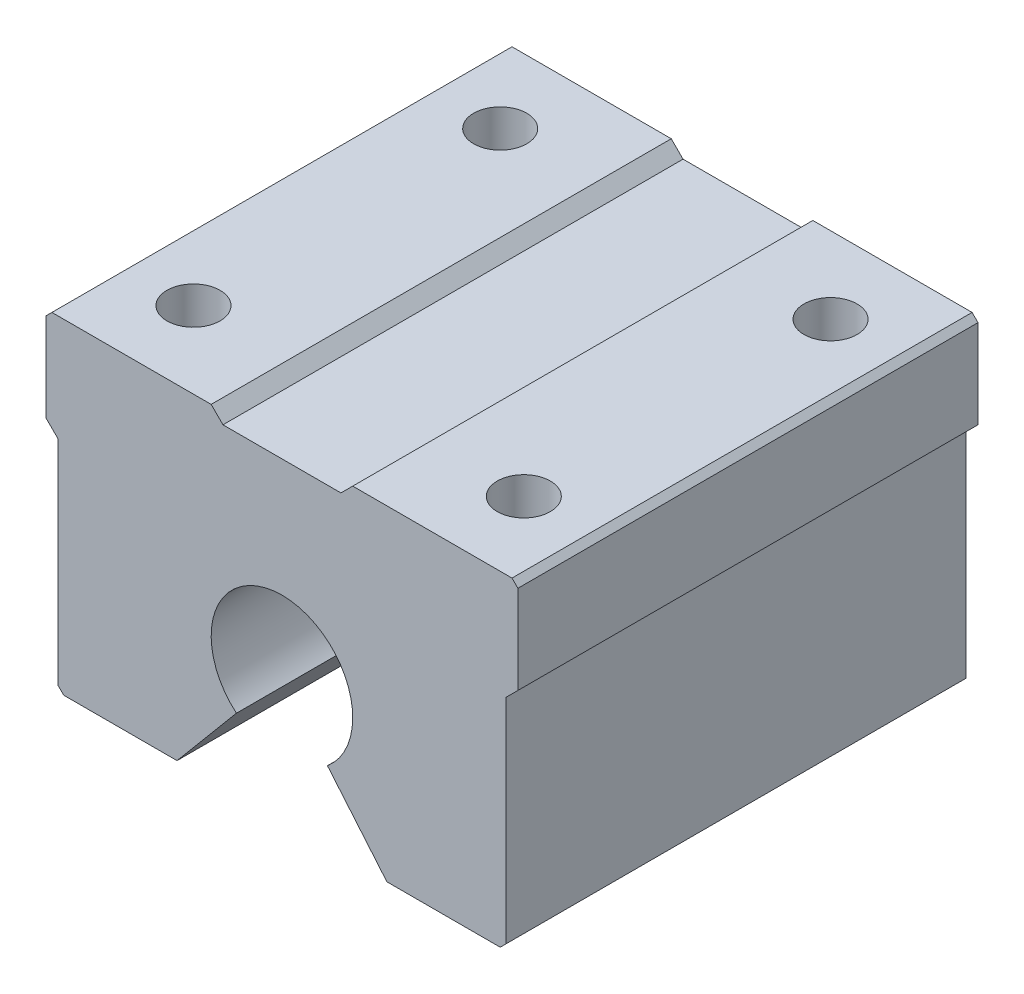
ISO-10303-21;
HEADER;
FILE_DESCRIPTION(('STEP AP214'),'2;1');
FILE_NAME('part.step','',(''),(''),'','','');
FILE_SCHEMA(('AUTOMOTIVE_DESIGN { 1 0 10303 214 1 1 1 1 }'));
ENDSEC;
DATA;
#1=APPLICATION_CONTEXT('core data for automotive mechanical design processes');
#2=APPLICATION_PROTOCOL_DEFINITION('international standard','automotive_design',2000,#1);
#3=PRODUCT_CONTEXT('',#1,'mechanical');
#4=PRODUCT('Part','Part','',(#3));
#5=PRODUCT_RELATED_PRODUCT_CATEGORY('part','',(#4));
#6=PRODUCT_DEFINITION_FORMATION('','',#4);
#7=PRODUCT_DEFINITION_CONTEXT('part definition',#1,'design');
#8=PRODUCT_DEFINITION('design','',#6,#7);
#9=PRODUCT_DEFINITION_SHAPE('','',#8);
#10=(LENGTH_UNIT() NAMED_UNIT(*) SI_UNIT(.MILLI.,.METRE.));
#11=(NAMED_UNIT(*) PLANE_ANGLE_UNIT() SI_UNIT($,.RADIAN.));
#12=(NAMED_UNIT(*) SI_UNIT($,.STERADIAN.) SOLID_ANGLE_UNIT());
#13=UNCERTAINTY_MEASURE_WITH_UNIT(LENGTH_MEASURE(1.E-05),#10,'distance_accuracy_value','');
#14=(GEOMETRIC_REPRESENTATION_CONTEXT(3) GLOBAL_UNCERTAINTY_ASSIGNED_CONTEXT((#13)) GLOBAL_UNIT_ASSIGNED_CONTEXT((#10,
#11,#12)) REPRESENTATION_CONTEXT('',''));
#15=CARTESIAN_POINT('',(0.,0.,0.));
#16=DIRECTION('',(0.,0.,1.));
#17=DIRECTION('',(1.,0.,0.));
#18=AXIS2_PLACEMENT_3D('',#15,#16,#17);
#19=CARTESIAN_POINT('',(-5.99999999999999,13.8,39.));
#20=DIRECTION('',(-0.707106781186549,-0.707106781186546,0.));
#21=DIRECTION('',(0.707106781186546,-0.707106781186549,0.));
#22=AXIS2_PLACEMENT_3D('',#19,#20,#21);
#23=PLANE('',#22);
#24=DIRECTION('',(-0.707106781186546,0.707106781186549,0.));
#25=VECTOR('',#24,1.);
#26=CARTESIAN_POINT('',(-5.99999999999999,13.8,0.));
#27=LINE('',#26,#25);
#28=CARTESIAN_POINT('',(-5.,12.8,0.));
#29=VERTEX_POINT('',#28);
#30=CARTESIAN_POINT('',(-5.99999999999999,13.8,0.));
#31=VERTEX_POINT('',#30);
#32=EDGE_CURVE('E203',#29,#31,#27,.T.);
#33=ORIENTED_EDGE('',*,*,#32,.T.);
#34=DIRECTION('',(0.,0.,-1.));
#35=VECTOR('',#34,1.);
#36=CARTESIAN_POINT('',(-5.99999999999999,13.8,39.));
#37=LINE('',#36,#35);
#38=CARTESIAN_POINT('',(-5.99999999999999,13.8,39.));
#39=VERTEX_POINT('',#38);
#40=EDGE_CURVE('E11',#39,#31,#37,.T.);
#41=ORIENTED_EDGE('',*,*,#40,.F.);
#42=DIRECTION('',(-0.707106781186546,0.707106781186549,0.));
#43=VECTOR('',#42,1.);
#44=CARTESIAN_POINT('',(-5.99999999999999,13.8,39.));
#45=LINE('',#44,#43);
#46=CARTESIAN_POINT('',(-5.,12.8,39.));
#47=VERTEX_POINT('',#46);
#48=EDGE_CURVE('E242',#47,#39,#45,.T.);
#49=ORIENTED_EDGE('',*,*,#48,.F.);
#50=DIRECTION('',(0.,0.,-1.));
#51=VECTOR('',#50,1.);
#52=CARTESIAN_POINT('',(-5.,12.8,39.));
#53=LINE('',#52,#51);
#54=EDGE_CURVE('E199',#47,#29,#53,.T.);
#55=ORIENTED_EDGE('',*,*,#54,.T.);
#56=EDGE_LOOP('',(#33,#41,#49,#55));
#57=FACE_BOUND('',#56,.T.);
#58=ADVANCED_FACE('F35',(#57),#23,.F.);
#59=CARTESIAN_POINT('',(-19.5,13.8,39.));
#60=DIRECTION('',(0.,-1.,0.));
#61=DIRECTION('',(0.,0.,-1.));
#62=AXIS2_PLACEMENT_3D('',#59,#60,#61);
#63=PLANE('',#62);
#64=CARTESIAN_POINT('',(-14.,13.8,32.5));
#65=DIRECTION('',(0.,1.,0.));
#66=DIRECTION('',(0.,0.,1.));
#67=AXIS2_PLACEMENT_3D('',#64,#65,#66);
#68=CIRCLE('',#67,2.25);
#69=CARTESIAN_POINT('',(-14.,13.8,34.75));
#70=VERTEX_POINT('',#69);
#71=EDGE_CURVE('E436',#70,#70,#68,.T.);
#72=ORIENTED_EDGE('',*,*,#71,.F.);
#73=EDGE_LOOP('',(#72));
#74=FACE_BOUND('',#73,.T.);
#75=CARTESIAN_POINT('',(-14.,13.8,6.5));
#76=DIRECTION('',(0.,1.,0.));
#77=DIRECTION('',(0.,0.,1.));
#78=AXIS2_PLACEMENT_3D('',#75,#76,#77);
#79=CIRCLE('',#78,2.25);
#80=CARTESIAN_POINT('',(-14.,13.8,8.75));
#81=VERTEX_POINT('',#80);
#82=EDGE_CURVE('E445',#81,#81,#79,.T.);
#83=ORIENTED_EDGE('',*,*,#82,.F.);
#84=EDGE_LOOP('',(#83));
#85=FACE_BOUND('',#84,.T.);
#86=DIRECTION('',(-1.,0.,0.));
#87=VECTOR('',#86,1.);
#88=CARTESIAN_POINT('',(-19.5,13.8,0.));
#89=LINE('',#88,#87);
#90=CARTESIAN_POINT('',(-19.5,13.8,0.));
#91=VERTEX_POINT('',#90);
#92=EDGE_CURVE('E206',#31,#91,#89,.T.);
#93=ORIENTED_EDGE('',*,*,#92,.T.);
#94=DIRECTION('',(0.,0.,-1.));
#95=VECTOR('',#94,1.);
#96=CARTESIAN_POINT('',(-19.5,13.8,39.));
#97=LINE('',#96,#95);
#98=CARTESIAN_POINT('',(-19.5,13.8,39.));
#99=VERTEX_POINT('',#98);
#100=EDGE_CURVE('E43',#99,#91,#97,.T.);
#101=ORIENTED_EDGE('',*,*,#100,.F.);
#102=DIRECTION('',(-1.,0.,0.));
#103=VECTOR('',#102,1.);
#104=CARTESIAN_POINT('',(-19.5,13.8,39.));
#105=LINE('',#104,#103);
#106=EDGE_CURVE('E130',#39,#99,#105,.T.);
#107=ORIENTED_EDGE('',*,*,#106,.F.);
#108=ORIENTED_EDGE('',*,*,#40,.T.);
#109=EDGE_LOOP('',(#93,#101,#107,#108));
#110=FACE_BOUND('',#109,.T.);
#111=ADVANCED_FACE('F360',(#74,#85,#110),#63,.F.);
#112=CARTESIAN_POINT('',(-20.,13.3,39.));
#113=DIRECTION('',(0.707106781186548,-0.707106781186548,0.));
#114=DIRECTION('',(0.707106781186548,0.707106781186548,0.));
#115=AXIS2_PLACEMENT_3D('',#112,#113,#114);
#116=PLANE('',#115);
#117=DIRECTION('',(-0.707106781186547,-0.707106781186547,0.));
#118=VECTOR('',#117,1.);
#119=CARTESIAN_POINT('',(-20.,13.3,0.));
#120=LINE('',#119,#118);
#121=CARTESIAN_POINT('',(-20.,13.3,0.));
#122=VERTEX_POINT('',#121);
#123=EDGE_CURVE('E209',#91,#122,#120,.T.);
#124=ORIENTED_EDGE('',*,*,#123,.T.);
#125=DIRECTION('',(0.,0.,-1.));
#126=VECTOR('',#125,1.);
#127=CARTESIAN_POINT('',(-20.,13.3,39.));
#128=LINE('',#127,#126);
#129=CARTESIAN_POINT('',(-20.,13.3,39.));
#130=VERTEX_POINT('',#129);
#131=EDGE_CURVE('E285',#130,#122,#128,.T.);
#132=ORIENTED_EDGE('',*,*,#131,.F.);
#133=DIRECTION('',(-0.707106781186547,-0.707106781186547,0.));
#134=VECTOR('',#133,1.);
#135=CARTESIAN_POINT('',(-20.,13.3,39.));
#136=LINE('',#135,#134);
#137=EDGE_CURVE('E293',#99,#130,#136,.T.);
#138=ORIENTED_EDGE('',*,*,#137,.F.);
#139=ORIENTED_EDGE('',*,*,#100,.T.);
#140=EDGE_LOOP('',(#124,#132,#138,#139));
#141=FACE_BOUND('',#140,.T.);
#142=ADVANCED_FACE('F291',(#141),#116,.F.);
#143=CARTESIAN_POINT('',(-20.,5.80000000000001,39.));
#144=DIRECTION('',(1.,0.,0.));
#145=DIRECTION('',(0.,0.,-1.));
#146=AXIS2_PLACEMENT_3D('',#143,#144,#145);
#147=PLANE('',#146);
#148=DIRECTION('',(0.,-1.,0.));
#149=VECTOR('',#148,1.);
#150=CARTESIAN_POINT('',(-20.,5.80000000000001,0.));
#151=LINE('',#150,#149);
#152=CARTESIAN_POINT('',(-20.,5.80000000000001,0.));
#153=VERTEX_POINT('',#152);
#154=EDGE_CURVE('E211',#122,#153,#151,.T.);
#155=ORIENTED_EDGE('',*,*,#154,.T.);
#156=DIRECTION('',(0.,0.,-1.));
#157=VECTOR('',#156,1.);
#158=CARTESIAN_POINT('',(-20.,5.80000000000001,39.));
#159=LINE('',#158,#157);
#160=CARTESIAN_POINT('',(-20.,5.80000000000001,39.));
#161=VERTEX_POINT('',#160);
#162=EDGE_CURVE('E282',#161,#153,#159,.T.);
#163=ORIENTED_EDGE('',*,*,#162,.F.);
#164=DIRECTION('',(0.,-1.,0.));
#165=VECTOR('',#164,1.);
#166=CARTESIAN_POINT('',(-20.,5.80000000000001,39.));
#167=LINE('',#166,#165);
#168=EDGE_CURVE('E311',#130,#161,#167,.T.);
#169=ORIENTED_EDGE('',*,*,#168,.F.);
#170=ORIENTED_EDGE('',*,*,#131,.T.);
#171=EDGE_LOOP('',(#155,#163,#169,#170));
#172=FACE_BOUND('',#171,.T.);
#173=ADVANCED_FACE('F302',(#172),#147,.F.);
#174=CARTESIAN_POINT('',(-20.,5.80000000000001,39.));
#175=DIRECTION('',(0.707106781186548,0.707106781186548,0.));
#176=DIRECTION('',(-0.707106781186548,0.707106781186548,0.));
#177=AXIS2_PLACEMENT_3D('',#174,#175,#176);
#178=PLANE('',#177);
#179=DIRECTION('',(0.707106781186547,-0.707106781186547,0.));
#180=VECTOR('',#179,1.);
#181=CARTESIAN_POINT('',(-20.,5.80000000000001,0.));
#182=LINE('',#181,#180);
#183=CARTESIAN_POINT('',(-19.,4.8,0.));
#184=VERTEX_POINT('',#183);
#185=EDGE_CURVE('E213',#153,#184,#182,.T.);
#186=ORIENTED_EDGE('',*,*,#185,.T.);
#187=DIRECTION('',(0.,0.,-1.));
#188=VECTOR('',#187,1.);
#189=CARTESIAN_POINT('',(-19.,4.8,39.));
#190=LINE('',#189,#188);
#191=CARTESIAN_POINT('',(-19.,4.8,39.));
#192=VERTEX_POINT('',#191);
#193=EDGE_CURVE('E279',#192,#184,#190,.T.);
#194=ORIENTED_EDGE('',*,*,#193,.F.);
#195=DIRECTION('',(0.707106781186547,-0.707106781186547,0.));
#196=VECTOR('',#195,1.);
#197=CARTESIAN_POINT('',(-20.,5.80000000000001,39.));
#198=LINE('',#197,#196);
#199=EDGE_CURVE('E308',#161,#192,#198,.T.);
#200=ORIENTED_EDGE('',*,*,#199,.F.);
#201=ORIENTED_EDGE('',*,*,#162,.T.);
#202=EDGE_LOOP('',(#186,#194,#200,#201));
#203=FACE_BOUND('',#202,.T.);
#204=ADVANCED_FACE('F306',(#203),#178,.F.);
#205=CARTESIAN_POINT('',(-19.,4.8,39.));
#206=DIRECTION('',(1.,0.,0.));
#207=DIRECTION('',(0.,1.,0.));
#208=AXIS2_PLACEMENT_3D('',#205,#206,#207);
#209=PLANE('',#208);
#210=DIRECTION('',(0.,-1.,0.));
#211=VECTOR('',#210,1.);
#212=CARTESIAN_POINT('',(-19.,4.8,0.));
#213=LINE('',#212,#211);
#214=CARTESIAN_POINT('',(-19.,-13.3,0.));
#215=VERTEX_POINT('',#214);
#216=EDGE_CURVE('E215',#184,#215,#213,.T.);
#217=ORIENTED_EDGE('',*,*,#216,.T.);
#218=DIRECTION('',(0.,0.,-1.));
#219=VECTOR('',#218,1.);
#220=CARTESIAN_POINT('',(-19.,-13.3,39.));
#221=LINE('',#220,#219);
#222=CARTESIAN_POINT('',(-19.,-13.3,39.));
#223=VERTEX_POINT('',#222);
#224=EDGE_CURVE('E276',#223,#215,#221,.T.);
#225=ORIENTED_EDGE('',*,*,#224,.F.);
#226=DIRECTION('',(0.,-1.,0.));
#227=VECTOR('',#226,1.);
#228=CARTESIAN_POINT('',(-19.,4.8,39.));
#229=LINE('',#228,#227);
#230=EDGE_CURVE('E310',#192,#223,#229,.T.);
#231=ORIENTED_EDGE('',*,*,#230,.F.);
#232=ORIENTED_EDGE('',*,*,#193,.T.);
#233=EDGE_LOOP('',(#217,#225,#231,#232));
#234=FACE_BOUND('',#233,.T.);
#235=ADVANCED_FACE('F376',(#234),#209,.F.);
#236=CARTESIAN_POINT('',(-19.,-13.3,39.));
#237=DIRECTION('',(0.707106781186548,0.707106781186548,0.));
#238=DIRECTION('',(-0.707106781186548,0.707106781186548,0.));
#239=AXIS2_PLACEMENT_3D('',#236,#237,#238);
#240=PLANE('',#239);
#241=DIRECTION('',(0.707106781186547,-0.707106781186547,0.));
#242=VECTOR('',#241,1.);
#243=CARTESIAN_POINT('',(-19.,-13.3,0.));
#244=LINE('',#243,#242);
#245=CARTESIAN_POINT('',(-18.5,-13.8,0.));
#246=VERTEX_POINT('',#245);
#247=EDGE_CURVE('E217',#215,#246,#244,.T.);
#248=ORIENTED_EDGE('',*,*,#247,.T.);
#249=DIRECTION('',(0.,0.,-1.));
#250=VECTOR('',#249,1.);
#251=CARTESIAN_POINT('',(-18.5,-13.8,39.));
#252=LINE('',#251,#250);
#253=CARTESIAN_POINT('',(-18.5,-13.8,39.));
#254=VERTEX_POINT('',#253);
#255=EDGE_CURVE('E273',#254,#246,#252,.T.);
#256=ORIENTED_EDGE('',*,*,#255,.F.);
#257=DIRECTION('',(0.707106781186547,-0.707106781186547,0.));
#258=VECTOR('',#257,1.);
#259=CARTESIAN_POINT('',(-19.,-13.3,39.));
#260=LINE('',#259,#258);
#261=EDGE_CURVE('E313',#223,#254,#260,.T.);
#262=ORIENTED_EDGE('',*,*,#261,.F.);
#263=ORIENTED_EDGE('',*,*,#224,.T.);
#264=EDGE_LOOP('',(#248,#256,#262,#263));
#265=FACE_BOUND('',#264,.T.);
#266=ADVANCED_FACE('F379',(#265),#240,.F.);
#267=CARTESIAN_POINT('',(-18.5,-13.8,39.));
#268=DIRECTION('',(0.,1.,0.));
#269=DIRECTION('',(-1.,0.,0.));
#270=AXIS2_PLACEMENT_3D('',#267,#268,#269);
#271=PLANE('',#270);
#272=DIRECTION('',(1.,0.,0.));
#273=VECTOR('',#272,1.);
#274=CARTESIAN_POINT('',(-18.5,-13.8,0.));
#275=LINE('',#274,#273);
#276=CARTESIAN_POINT('',(-8.89445609047906,-13.8,0.));
#277=VERTEX_POINT('',#276);
#278=EDGE_CURVE('E219',#246,#277,#275,.T.);
#279=ORIENTED_EDGE('',*,*,#278,.T.);
#280=DIRECTION('',(0.,0.,-1.));
#281=VECTOR('',#280,1.);
#282=CARTESIAN_POINT('',(-8.89445609047906,-13.8,39.));
#283=LINE('',#282,#281);
#284=CARTESIAN_POINT('',(-8.89445609047906,-13.8,39.));
#285=VERTEX_POINT('',#284);
#286=EDGE_CURVE('E270',#285,#277,#283,.T.);
#287=ORIENTED_EDGE('',*,*,#286,.F.);
#288=DIRECTION('',(1.,0.,0.));
#289=VECTOR('',#288,1.);
#290=CARTESIAN_POINT('',(-18.5,-13.8,39.));
#291=LINE('',#290,#289);
#292=EDGE_CURVE('E319',#254,#285,#291,.T.);
#293=ORIENTED_EDGE('',*,*,#292,.F.);
#294=ORIENTED_EDGE('',*,*,#255,.T.);
#295=EDGE_LOOP('',(#279,#287,#293,#294));
#296=FACE_BOUND('',#295,.T.);
#297=ADVANCED_FACE('F383',(#296),#271,.F.);
#298=CARTESIAN_POINT('',(-3.85672565811921,-7.79626665871389,39.));
#299=DIRECTION('',(-0.766044443118982,0.642787609686535,0.));
#300=DIRECTION('',(-0.642787609686535,-0.766044443118982,0.));
#301=AXIS2_PLACEMENT_3D('',#298,#299,#300);
#302=PLANE('',#301);
#303=DIRECTION('',(0.642787609686535,0.766044443118982,0.));
#304=VECTOR('',#303,1.);
#305=CARTESIAN_POINT('',(-3.85672565811921,-7.79626665871389,0.));
#306=LINE('',#305,#304);
#307=CARTESIAN_POINT('',(-3.85672565811921,-7.79626665871389,0.));
#308=VERTEX_POINT('',#307);
#309=EDGE_CURVE('E221',#277,#308,#306,.T.);
#310=ORIENTED_EDGE('',*,*,#309,.T.);
#311=DIRECTION('',(0.,0.,-1.));
#312=VECTOR('',#311,1.);
#313=CARTESIAN_POINT('',(-3.85672565811921,-7.79626665871389,39.));
#314=LINE('',#313,#312);
#315=CARTESIAN_POINT('',(-3.85672565811921,-7.79626665871389,39.));
#316=VERTEX_POINT('',#315);
#317=EDGE_CURVE('E267',#316,#308,#314,.T.);
#318=ORIENTED_EDGE('',*,*,#317,.F.);
#319=DIRECTION('',(0.642787609686535,0.766044443118982,0.));
#320=VECTOR('',#319,1.);
#321=CARTESIAN_POINT('',(-3.85672565811921,-7.79626665871389,39.));
#322=LINE('',#321,#320);
#323=EDGE_CURVE('E321',#285,#316,#322,.T.);
#324=ORIENTED_EDGE('',*,*,#323,.F.);
#325=ORIENTED_EDGE('',*,*,#286,.T.);
#326=EDGE_LOOP('',(#310,#318,#324,#325));
#327=FACE_BOUND('',#326,.T.);
#328=ADVANCED_FACE('F387',(#327),#302,.F.);
#329=CARTESIAN_POINT('',(0.,-3.2,39.));
#330=DIRECTION('',(0.,0.,-1.));
#331=DIRECTION('',(-1.,0.,0.));
#332=AXIS2_PLACEMENT_3D('',#329,#330,#331);
#333=CYLINDRICAL_SURFACE('',#332,6.);
#334=CARTESIAN_POINT('',(0.,-3.2,0.));
#335=DIRECTION('',(0.,0.,-1.));
#336=DIRECTION('',(1.,0.,0.));
#337=AXIS2_PLACEMENT_3D('',#334,#335,#336);
#338=CIRCLE('',#337,6.);
#339=CARTESIAN_POINT('',(3.85672565811921,-7.79626665871389,0.));
#340=VERTEX_POINT('',#339);
#341=EDGE_CURVE('E223',#308,#340,#338,.T.);
#342=ORIENTED_EDGE('',*,*,#341,.T.);
#343=DIRECTION('',(0.,0.,-1.));
#344=VECTOR('',#343,1.);
#345=CARTESIAN_POINT('',(3.85672565811921,-7.79626665871389,39.));
#346=LINE('',#345,#344);
#347=CARTESIAN_POINT('',(3.85672565811921,-7.79626665871389,39.));
#348=VERTEX_POINT('',#347);
#349=EDGE_CURVE('E264',#348,#340,#346,.T.);
#350=ORIENTED_EDGE('',*,*,#349,.F.);
#351=CARTESIAN_POINT('',(0.,-3.2,39.));
#352=DIRECTION('',(0.,0.,-1.));
#353=DIRECTION('',(1.,0.,0.));
#354=AXIS2_PLACEMENT_3D('',#351,#352,#353);
#355=CIRCLE('',#354,6.);
#356=EDGE_CURVE('E323',#316,#348,#355,.T.);
#357=ORIENTED_EDGE('',*,*,#356,.F.);
#358=ORIENTED_EDGE('',*,*,#317,.T.);
#359=EDGE_LOOP('',(#342,#350,#357,#358));
#360=FACE_BOUND('',#359,.T.);
#361=ADVANCED_FACE('F391',(#360),#333,.F.);
#362=CARTESIAN_POINT('',(3.85672565811921,-7.79626665871389,39.));
#363=DIRECTION('',(0.766044443118982,0.642787609686535,0.));
#364=DIRECTION('',(-0.642787609686535,0.766044443118982,0.));
#365=AXIS2_PLACEMENT_3D('',#362,#363,#364);
#366=PLANE('',#365);
#367=DIRECTION('',(0.642787609686535,-0.766044443118982,0.));
#368=VECTOR('',#367,1.);
#369=CARTESIAN_POINT('',(3.85672565811921,-7.79626665871389,0.));
#370=LINE('',#369,#368);
#371=CARTESIAN_POINT('',(8.89445609047907,-13.8,0.));
#372=VERTEX_POINT('',#371);
#373=EDGE_CURVE('E225',#340,#372,#370,.T.);
#374=ORIENTED_EDGE('',*,*,#373,.T.);
#375=DIRECTION('',(0.,0.,-1.));
#376=VECTOR('',#375,1.);
#377=CARTESIAN_POINT('',(8.89445609047907,-13.8,39.));
#378=LINE('',#377,#376);
#379=CARTESIAN_POINT('',(8.89445609047907,-13.8,39.));
#380=VERTEX_POINT('',#379);
#381=EDGE_CURVE('E261',#380,#372,#378,.T.);
#382=ORIENTED_EDGE('',*,*,#381,.F.);
#383=DIRECTION('',(0.642787609686535,-0.766044443118982,0.));
#384=VECTOR('',#383,1.);
#385=CARTESIAN_POINT('',(3.85672565811921,-7.79626665871389,39.));
#386=LINE('',#385,#384);
#387=EDGE_CURVE('E325',#348,#380,#386,.T.);
#388=ORIENTED_EDGE('',*,*,#387,.F.);
#389=ORIENTED_EDGE('',*,*,#349,.T.);
#390=EDGE_LOOP('',(#374,#382,#388,#389));
#391=FACE_BOUND('',#390,.T.);
#392=ADVANCED_FACE('F395',(#391),#366,.F.);
#393=CARTESIAN_POINT('',(8.89445609047907,-13.8,39.));
#394=DIRECTION('',(0.,1.,0.));
#395=DIRECTION('',(-1.,0.,0.));
#396=AXIS2_PLACEMENT_3D('',#393,#394,#395);
#397=PLANE('',#396);
#398=DIRECTION('',(1.,0.,0.));
#399=VECTOR('',#398,1.);
#400=CARTESIAN_POINT('',(8.89445609047907,-13.8,0.));
#401=LINE('',#400,#399);
#402=CARTESIAN_POINT('',(18.5,-13.8,0.));
#403=VERTEX_POINT('',#402);
#404=EDGE_CURVE('E227',#372,#403,#401,.T.);
#405=ORIENTED_EDGE('',*,*,#404,.T.);
#406=DIRECTION('',(0.,0.,-1.));
#407=VECTOR('',#406,1.);
#408=CARTESIAN_POINT('',(18.5,-13.8,39.));
#409=LINE('',#408,#407);
#410=CARTESIAN_POINT('',(18.5,-13.8,39.));
#411=VERTEX_POINT('',#410);
#412=EDGE_CURVE('E258',#411,#403,#409,.T.);
#413=ORIENTED_EDGE('',*,*,#412,.F.);
#414=DIRECTION('',(1.,0.,0.));
#415=VECTOR('',#414,1.);
#416=CARTESIAN_POINT('',(8.89445609047907,-13.8,39.));
#417=LINE('',#416,#415);
#418=EDGE_CURVE('E327',#380,#411,#417,.T.);
#419=ORIENTED_EDGE('',*,*,#418,.F.);
#420=ORIENTED_EDGE('',*,*,#381,.T.);
#421=EDGE_LOOP('',(#405,#413,#419,#420));
#422=FACE_BOUND('',#421,.T.);
#423=ADVANCED_FACE('F399',(#422),#397,.F.);
#424=CARTESIAN_POINT('',(19.,-13.3,39.));
#425=DIRECTION('',(-0.707106781186548,0.707106781186548,0.));
#426=DIRECTION('',(-0.707106781186548,-0.707106781186548,0.));
#427=AXIS2_PLACEMENT_3D('',#424,#425,#426);
#428=PLANE('',#427);
#429=DIRECTION('',(0.707106781186547,0.707106781186547,0.));
#430=VECTOR('',#429,1.);
#431=CARTESIAN_POINT('',(19.,-13.3,0.));
#432=LINE('',#431,#430);
#433=CARTESIAN_POINT('',(19.,-13.3,0.));
#434=VERTEX_POINT('',#433);
#435=EDGE_CURVE('E229',#403,#434,#432,.T.);
#436=ORIENTED_EDGE('',*,*,#435,.T.);
#437=DIRECTION('',(0.,0.,-1.));
#438=VECTOR('',#437,1.);
#439=CARTESIAN_POINT('',(19.,-13.3,39.));
#440=LINE('',#439,#438);
#441=CARTESIAN_POINT('',(19.,-13.3,39.));
#442=VERTEX_POINT('',#441);
#443=EDGE_CURVE('E255',#442,#434,#440,.T.);
#444=ORIENTED_EDGE('',*,*,#443,.F.);
#445=DIRECTION('',(0.707106781186547,0.707106781186547,0.));
#446=VECTOR('',#445,1.);
#447=CARTESIAN_POINT('',(19.,-13.3,39.));
#448=LINE('',#447,#446);
#449=EDGE_CURVE('E329',#411,#442,#448,.T.);
#450=ORIENTED_EDGE('',*,*,#449,.F.);
#451=ORIENTED_EDGE('',*,*,#412,.T.);
#452=EDGE_LOOP('',(#436,#444,#450,#451));
#453=FACE_BOUND('',#452,.T.);
#454=ADVANCED_FACE('F403',(#453),#428,.F.);
#455=CARTESIAN_POINT('',(19.,4.8,39.));
#456=DIRECTION('',(-1.,0.,0.));
#457=DIRECTION('',(0.,-1.,0.));
#458=AXIS2_PLACEMENT_3D('',#455,#456,#457);
#459=PLANE('',#458);
#460=DIRECTION('',(0.,1.,0.));
#461=VECTOR('',#460,1.);
#462=CARTESIAN_POINT('',(19.,4.8,0.));
#463=LINE('',#462,#461);
#464=CARTESIAN_POINT('',(19.,4.8,0.));
#465=VERTEX_POINT('',#464);
#466=EDGE_CURVE('E231',#434,#465,#463,.T.);
#467=ORIENTED_EDGE('',*,*,#466,.T.);
#468=DIRECTION('',(0.,0.,-1.));
#469=VECTOR('',#468,1.);
#470=CARTESIAN_POINT('',(19.,4.8,39.));
#471=LINE('',#470,#469);
#472=CARTESIAN_POINT('',(19.,4.8,39.));
#473=VERTEX_POINT('',#472);
#474=EDGE_CURVE('E252',#473,#465,#471,.T.);
#475=ORIENTED_EDGE('',*,*,#474,.F.);
#476=DIRECTION('',(0.,1.,0.));
#477=VECTOR('',#476,1.);
#478=CARTESIAN_POINT('',(19.,4.8,39.));
#479=LINE('',#478,#477);
#480=EDGE_CURVE('E331',#442,#473,#479,.T.);
#481=ORIENTED_EDGE('',*,*,#480,.F.);
#482=ORIENTED_EDGE('',*,*,#443,.T.);
#483=EDGE_LOOP('',(#467,#475,#481,#482));
#484=FACE_BOUND('',#483,.T.);
#485=ADVANCED_FACE('F407',(#484),#459,.F.);
#486=CARTESIAN_POINT('',(20.,5.80000000000001,39.));
#487=DIRECTION('',(-0.707106781186548,0.707106781186548,0.));
#488=DIRECTION('',(-0.707106781186548,-0.707106781186548,0.));
#489=AXIS2_PLACEMENT_3D('',#486,#487,#488);
#490=PLANE('',#489);
#491=DIRECTION('',(0.707106781186547,0.707106781186547,0.));
#492=VECTOR('',#491,1.);
#493=CARTESIAN_POINT('',(20.,5.80000000000001,0.));
#494=LINE('',#493,#492);
#495=CARTESIAN_POINT('',(20.,5.80000000000001,0.));
#496=VERTEX_POINT('',#495);
#497=EDGE_CURVE('E233',#465,#496,#494,.T.);
#498=ORIENTED_EDGE('',*,*,#497,.T.);
#499=DIRECTION('',(0.,0.,-1.));
#500=VECTOR('',#499,1.);
#501=CARTESIAN_POINT('',(20.,5.80000000000001,39.));
#502=LINE('',#501,#500);
#503=CARTESIAN_POINT('',(20.,5.80000000000001,39.));
#504=VERTEX_POINT('',#503);
#505=EDGE_CURVE('E249',#504,#496,#502,.T.);
#506=ORIENTED_EDGE('',*,*,#505,.F.);
#507=DIRECTION('',(0.707106781186547,0.707106781186547,0.));
#508=VECTOR('',#507,1.);
#509=CARTESIAN_POINT('',(20.,5.80000000000001,39.));
#510=LINE('',#509,#508);
#511=EDGE_CURVE('E333',#473,#504,#510,.T.);
#512=ORIENTED_EDGE('',*,*,#511,.F.);
#513=ORIENTED_EDGE('',*,*,#474,.T.);
#514=EDGE_LOOP('',(#498,#506,#512,#513));
#515=FACE_BOUND('',#514,.T.);
#516=ADVANCED_FACE('F411',(#515),#490,.F.);
#517=CARTESIAN_POINT('',(20.,5.80000000000001,39.));
#518=DIRECTION('',(-1.,0.,0.));
#519=DIRECTION('',(0.,0.,1.));
#520=AXIS2_PLACEMENT_3D('',#517,#518,#519);
#521=PLANE('',#520);
#522=DIRECTION('',(0.,1.,0.));
#523=VECTOR('',#522,1.);
#524=CARTESIAN_POINT('',(20.,5.80000000000001,0.));
#525=LINE('',#524,#523);
#526=CARTESIAN_POINT('',(20.,13.3,0.));
#527=VERTEX_POINT('',#526);
#528=EDGE_CURVE('E235',#496,#527,#525,.T.);
#529=ORIENTED_EDGE('',*,*,#528,.T.);
#530=DIRECTION('',(0.,0.,-1.));
#531=VECTOR('',#530,1.);
#532=CARTESIAN_POINT('',(20.,13.3,39.));
#533=LINE('',#532,#531);
#534=CARTESIAN_POINT('',(20.,13.3,39.));
#535=VERTEX_POINT('',#534);
#536=EDGE_CURVE('E246',#535,#527,#533,.T.);
#537=ORIENTED_EDGE('',*,*,#536,.F.);
#538=DIRECTION('',(0.,1.,0.));
#539=VECTOR('',#538,1.);
#540=CARTESIAN_POINT('',(20.,5.80000000000001,39.));
#541=LINE('',#540,#539);
#542=EDGE_CURVE('E335',#504,#535,#541,.T.);
#543=ORIENTED_EDGE('',*,*,#542,.F.);
#544=ORIENTED_EDGE('',*,*,#505,.T.);
#545=EDGE_LOOP('',(#529,#537,#543,#544));
#546=FACE_BOUND('',#545,.T.);
#547=ADVANCED_FACE('F341',(#546),#521,.F.);
#548=CARTESIAN_POINT('',(19.5,13.8,39.));
#549=DIRECTION('',(-0.707106781186548,-0.707106781186548,0.));
#550=DIRECTION('',(0.707106781186548,-0.707106781186548,0.));
#551=AXIS2_PLACEMENT_3D('',#548,#549,#550);
#552=PLANE('',#551);
#553=DIRECTION('',(-0.707106781186547,0.707106781186547,0.));
#554=VECTOR('',#553,1.);
#555=CARTESIAN_POINT('',(19.5,13.8,0.));
#556=LINE('',#555,#554);
#557=CARTESIAN_POINT('',(19.5,13.8,0.));
#558=VERTEX_POINT('',#557);
#559=EDGE_CURVE('E237',#527,#558,#556,.T.);
#560=ORIENTED_EDGE('',*,*,#559,.T.);
#561=DIRECTION('',(0.,0.,-1.));
#562=VECTOR('',#561,1.);
#563=CARTESIAN_POINT('',(19.5,13.8,39.));
#564=LINE('',#563,#562);
#565=CARTESIAN_POINT('',(19.5,13.8,39.));
#566=VERTEX_POINT('',#565);
#567=EDGE_CURVE('E194',#566,#558,#564,.T.);
#568=ORIENTED_EDGE('',*,*,#567,.F.);
#569=DIRECTION('',(-0.707106781186547,0.707106781186547,0.));
#570=VECTOR('',#569,1.);
#571=CARTESIAN_POINT('',(19.5,13.8,39.));
#572=LINE('',#571,#570);
#573=EDGE_CURVE('E185',#535,#566,#572,.T.);
#574=ORIENTED_EDGE('',*,*,#573,.F.);
#575=ORIENTED_EDGE('',*,*,#536,.T.);
#576=EDGE_LOOP('',(#560,#568,#574,#575));
#577=FACE_BOUND('',#576,.T.);
#578=ADVANCED_FACE('F345',(#577),#552,.F.);
#579=CARTESIAN_POINT('',(6.,13.8,39.));
#580=DIRECTION('',(0.,-1.,0.));
#581=DIRECTION('',(0.,0.,-1.));
#582=AXIS2_PLACEMENT_3D('',#579,#580,#581);
#583=PLANE('',#582);
#584=CARTESIAN_POINT('',(14.,13.8,6.5));
#585=DIRECTION('',(0.,1.,0.));
#586=DIRECTION('',(0.,0.,1.));
#587=AXIS2_PLACEMENT_3D('',#584,#585,#586);
#588=CIRCLE('',#587,2.25);
#589=CARTESIAN_POINT('',(14.,13.8,8.75));
#590=VERTEX_POINT('',#589);
#591=EDGE_CURVE('E427',#590,#590,#588,.T.);
#592=ORIENTED_EDGE('',*,*,#591,.F.);
#593=EDGE_LOOP('',(#592));
#594=FACE_BOUND('',#593,.T.);
#595=CARTESIAN_POINT('',(14.,13.8,32.5));
#596=DIRECTION('',(0.,1.,0.));
#597=DIRECTION('',(0.,0.,1.));
#598=AXIS2_PLACEMENT_3D('',#595,#596,#597);
#599=CIRCLE('',#598,2.25);
#600=CARTESIAN_POINT('',(14.,13.8,34.75));
#601=VERTEX_POINT('',#600);
#602=EDGE_CURVE('E430',#601,#601,#599,.T.);
#603=ORIENTED_EDGE('',*,*,#602,.F.);
#604=EDGE_LOOP('',(#603));
#605=FACE_BOUND('',#604,.T.);
#606=DIRECTION('',(-1.,0.,0.));
#607=VECTOR('',#606,1.);
#608=CARTESIAN_POINT('',(6.,13.8,0.));
#609=LINE('',#608,#607);
#610=CARTESIAN_POINT('',(6.,13.8,0.));
#611=VERTEX_POINT('',#610);
#612=EDGE_CURVE('E193',#558,#611,#609,.T.);
#613=ORIENTED_EDGE('',*,*,#612,.T.);
#614=DIRECTION('',(0.,0.,-1.));
#615=VECTOR('',#614,1.);
#616=CARTESIAN_POINT('',(6.,13.8,39.));
#617=LINE('',#616,#615);
#618=CARTESIAN_POINT('',(6.,13.8,39.));
#619=VERTEX_POINT('',#618);
#620=EDGE_CURVE('E190',#619,#611,#617,.T.);
#621=ORIENTED_EDGE('',*,*,#620,.F.);
#622=DIRECTION('',(-1.,0.,0.));
#623=VECTOR('',#622,1.);
#624=CARTESIAN_POINT('',(6.,13.8,39.));
#625=LINE('',#624,#623);
#626=EDGE_CURVE('E179',#566,#619,#625,.T.);
#627=ORIENTED_EDGE('',*,*,#626,.F.);
#628=ORIENTED_EDGE('',*,*,#567,.T.);
#629=EDGE_LOOP('',(#613,#621,#627,#628));
#630=FACE_BOUND('',#629,.T.);
#631=ADVANCED_FACE('F191',(#594,#605,#630),#583,.F.);
#632=CARTESIAN_POINT('',(5.,12.8,39.));
#633=DIRECTION('',(0.707106781186546,-0.707106781186549,0.));
#634=DIRECTION('',(0.707106781186549,0.707106781186546,0.));
#635=AXIS2_PLACEMENT_3D('',#632,#633,#634);
#636=PLANE('',#635);
#637=DIRECTION('',(-0.707106781186549,-0.707106781186546,0.));
#638=VECTOR('',#637,1.);
#639=CARTESIAN_POINT('',(5.,12.8,0.));
#640=LINE('',#639,#638);
#641=CARTESIAN_POINT('',(5.,12.8,0.));
#642=VERTEX_POINT('',#641);
#643=EDGE_CURVE('E116',#611,#642,#640,.T.);
#644=ORIENTED_EDGE('',*,*,#643,.T.);
#645=DIRECTION('',(0.,0.,-1.));
#646=VECTOR('',#645,1.);
#647=CARTESIAN_POINT('',(5.,12.8,39.));
#648=LINE('',#647,#646);
#649=CARTESIAN_POINT('',(5.,12.8,39.));
#650=VERTEX_POINT('',#649);
#651=EDGE_CURVE('E195',#650,#642,#648,.T.);
#652=ORIENTED_EDGE('',*,*,#651,.F.);
#653=DIRECTION('',(-0.707106781186549,-0.707106781186546,0.));
#654=VECTOR('',#653,1.);
#655=CARTESIAN_POINT('',(5.,12.8,39.));
#656=LINE('',#655,#654);
#657=EDGE_CURVE('E183',#619,#650,#656,.T.);
#658=ORIENTED_EDGE('',*,*,#657,.F.);
#659=ORIENTED_EDGE('',*,*,#620,.T.);
#660=EDGE_LOOP('',(#644,#652,#658,#659));
#661=FACE_BOUND('',#660,.T.);
#662=ADVANCED_FACE('F197',(#661),#636,.F.);
#663=CARTESIAN_POINT('',(-5.,12.8,39.));
#664=DIRECTION('',(0.,-1.,0.));
#665=DIRECTION('',(0.,0.,-1.));
#666=AXIS2_PLACEMENT_3D('',#663,#664,#665);
#667=PLANE('',#666);
#668=DIRECTION('',(-1.,0.,0.));
#669=VECTOR('',#668,1.);
#670=CARTESIAN_POINT('',(-5.,12.8,0.));
#671=LINE('',#670,#669);
#672=EDGE_CURVE('E122',#642,#29,#671,.T.);
#673=ORIENTED_EDGE('',*,*,#672,.T.);
#674=ORIENTED_EDGE('',*,*,#54,.F.);
#675=DIRECTION('',(-1.,0.,0.));
#676=VECTOR('',#675,1.);
#677=CARTESIAN_POINT('',(-5.,12.8,39.));
#678=LINE('',#677,#676);
#679=EDGE_CURVE('E51',#650,#47,#678,.T.);
#680=ORIENTED_EDGE('',*,*,#679,.F.);
#681=ORIENTED_EDGE('',*,*,#651,.T.);
#682=EDGE_LOOP('',(#673,#674,#680,#681));
#683=FACE_BOUND('',#682,.T.);
#684=ADVANCED_FACE('F349',(#683),#667,.F.);
#685=CARTESIAN_POINT('',(0.,-3.2,39.));
#686=DIRECTION('',(0.,0.,1.));
#687=DIRECTION('',(1.,0.,0.));
#688=AXIS2_PLACEMENT_3D('',#685,#686,#687);
#689=PLANE('',#688);
#690=ORIENTED_EDGE('',*,*,#48,.T.);
#691=ORIENTED_EDGE('',*,*,#106,.T.);
#692=ORIENTED_EDGE('',*,*,#137,.T.);
#693=ORIENTED_EDGE('',*,*,#168,.T.);
#694=ORIENTED_EDGE('',*,*,#199,.T.);
#695=ORIENTED_EDGE('',*,*,#230,.T.);
#696=ORIENTED_EDGE('',*,*,#261,.T.);
#697=ORIENTED_EDGE('',*,*,#292,.T.);
#698=ORIENTED_EDGE('',*,*,#323,.T.);
#699=ORIENTED_EDGE('',*,*,#356,.T.);
#700=ORIENTED_EDGE('',*,*,#387,.T.);
#701=ORIENTED_EDGE('',*,*,#418,.T.);
#702=ORIENTED_EDGE('',*,*,#449,.T.);
#703=ORIENTED_EDGE('',*,*,#480,.T.);
#704=ORIENTED_EDGE('',*,*,#511,.T.);
#705=ORIENTED_EDGE('',*,*,#542,.T.);
#706=ORIENTED_EDGE('',*,*,#573,.T.);
#707=ORIENTED_EDGE('',*,*,#626,.T.);
#708=ORIENTED_EDGE('',*,*,#657,.T.);
#709=ORIENTED_EDGE('',*,*,#679,.T.);
#710=EDGE_LOOP('',(#690,#691,#692,#693,#694,#695,#696,#697,#698,#699,#700,#701,#702,#703,#704,
#705,#706,#707,#708,#709));
#711=FACE_BOUND('',#710,.T.);
#712=ADVANCED_FACE('F181',(#711),#689,.T.);
#713=CARTESIAN_POINT('',(0.,-3.2,0.));
#714=DIRECTION('',(0.,0.,1.));
#715=DIRECTION('',(1.,0.,0.));
#716=AXIS2_PLACEMENT_3D('',#713,#714,#715);
#717=PLANE('',#716);
#718=ORIENTED_EDGE('',*,*,#32,.F.);
#719=ORIENTED_EDGE('',*,*,#672,.F.);
#720=ORIENTED_EDGE('',*,*,#643,.F.);
#721=ORIENTED_EDGE('',*,*,#612,.F.);
#722=ORIENTED_EDGE('',*,*,#559,.F.);
#723=ORIENTED_EDGE('',*,*,#528,.F.);
#724=ORIENTED_EDGE('',*,*,#497,.F.);
#725=ORIENTED_EDGE('',*,*,#466,.F.);
#726=ORIENTED_EDGE('',*,*,#435,.F.);
#727=ORIENTED_EDGE('',*,*,#404,.F.);
#728=ORIENTED_EDGE('',*,*,#373,.F.);
#729=ORIENTED_EDGE('',*,*,#341,.F.);
#730=ORIENTED_EDGE('',*,*,#309,.F.);
#731=ORIENTED_EDGE('',*,*,#278,.F.);
#732=ORIENTED_EDGE('',*,*,#247,.F.);
#733=ORIENTED_EDGE('',*,*,#216,.F.);
#734=ORIENTED_EDGE('',*,*,#185,.F.);
#735=ORIENTED_EDGE('',*,*,#154,.F.);
#736=ORIENTED_EDGE('',*,*,#123,.F.);
#737=ORIENTED_EDGE('',*,*,#92,.F.);
#738=EDGE_LOOP('',(#718,#719,#720,#721,#722,#723,#724,#725,#726,#727,#728,#729,#730,#731,#732,
#733,#734,#735,#736,#737));
#739=FACE_BOUND('',#738,.T.);
#740=ADVANCED_FACE('F297',(#739),#717,.F.);
#741=CARTESIAN_POINT('',(14.,3.8,32.5));
#742=DIRECTION('',(0.,1.,0.));
#743=DIRECTION('',(0.,0.,1.));
#744=AXIS2_PLACEMENT_3D('',#741,#742,#743);
#745=CYLINDRICAL_SURFACE('',#744,2.25);
#746=CARTESIAN_POINT('',(14.,3.8,32.5));
#747=DIRECTION('',(0.,1.,0.));
#748=DIRECTION('',(0.,0.,1.));
#749=AXIS2_PLACEMENT_3D('',#746,#747,#748);
#750=CIRCLE('',#749,2.25);
#751=CARTESIAN_POINT('',(14.,3.8,34.75));
#752=VERTEX_POINT('',#751);
#753=EDGE_CURVE('E432',#752,#752,#750,.T.);
#754=ORIENTED_EDGE('',*,*,#753,.F.);
#755=EDGE_LOOP('',(#754));
#756=FACE_BOUND('',#755,.T.);
#757=ORIENTED_EDGE('',*,*,#602,.T.);
#758=EDGE_LOOP('',(#757));
#759=FACE_BOUND('',#758,.T.);
#760=ADVANCED_FACE('F477',(#756,#759),#745,.F.);
#761=CARTESIAN_POINT('',(14.,3.8,32.5));
#762=DIRECTION('',(0.,1.,0.));
#763=DIRECTION('',(0.,0.,1.));
#764=AXIS2_PLACEMENT_3D('',#761,#762,#763);
#765=PLANE('',#764);
#766=ORIENTED_EDGE('',*,*,#753,.T.);
#767=EDGE_LOOP('',(#766));
#768=FACE_BOUND('',#767,.T.);
#769=ADVANCED_FACE('F473',(#768),#765,.T.);
#770=CARTESIAN_POINT('',(14.,3.8,6.5));
#771=DIRECTION('',(0.,1.,0.));
#772=DIRECTION('',(0.,0.,1.));
#773=AXIS2_PLACEMENT_3D('',#770,#771,#772);
#774=CYLINDRICAL_SURFACE('',#773,2.25);
#775=CARTESIAN_POINT('',(14.,3.8,6.5));
#776=DIRECTION('',(0.,1.,0.));
#777=DIRECTION('',(0.,0.,1.));
#778=AXIS2_PLACEMENT_3D('',#775,#776,#777);
#779=CIRCLE('',#778,2.25);
#780=CARTESIAN_POINT('',(14.,3.8,8.75));
#781=VERTEX_POINT('',#780);
#782=EDGE_CURVE('E433',#781,#781,#779,.T.);
#783=ORIENTED_EDGE('',*,*,#782,.F.);
#784=EDGE_LOOP('',(#783));
#785=FACE_BOUND('',#784,.T.);
#786=ORIENTED_EDGE('',*,*,#591,.T.);
#787=EDGE_LOOP('',(#786));
#788=FACE_BOUND('',#787,.T.);
#789=ADVANCED_FACE('F476',(#785,#788),#774,.F.);
#790=CARTESIAN_POINT('',(14.,3.8,6.5));
#791=DIRECTION('',(0.,1.,0.));
#792=DIRECTION('',(0.,0.,1.));
#793=AXIS2_PLACEMENT_3D('',#790,#791,#792);
#794=PLANE('',#793);
#795=ORIENTED_EDGE('',*,*,#782,.T.);
#796=EDGE_LOOP('',(#795));
#797=FACE_BOUND('',#796,.T.);
#798=ADVANCED_FACE('F482',(#797),#794,.T.);
#799=CARTESIAN_POINT('',(-14.,3.8,6.5));
#800=DIRECTION('',(0.,1.,0.));
#801=DIRECTION('',(0.,0.,1.));
#802=AXIS2_PLACEMENT_3D('',#799,#800,#801);
#803=CYLINDRICAL_SURFACE('',#802,2.25);
#804=CARTESIAN_POINT('',(-14.,3.8,6.5));
#805=DIRECTION('',(0.,1.,0.));
#806=DIRECTION('',(0.,0.,1.));
#807=AXIS2_PLACEMENT_3D('',#804,#805,#806);
#808=CIRCLE('',#807,2.25);
#809=CARTESIAN_POINT('',(-14.,3.8,8.75));
#810=VERTEX_POINT('',#809);
#811=EDGE_CURVE('E207',#810,#810,#808,.T.);
#812=ORIENTED_EDGE('',*,*,#811,.F.);
#813=EDGE_LOOP('',(#812));
#814=FACE_BOUND('',#813,.T.);
#815=ORIENTED_EDGE('',*,*,#82,.T.);
#816=EDGE_LOOP('',(#815));
#817=FACE_BOUND('',#816,.T.);
#818=ADVANCED_FACE('F469',(#814,#817),#803,.F.);
#819=CARTESIAN_POINT('',(-14.,3.8,6.5));
#820=DIRECTION('',(0.,1.,0.));
#821=DIRECTION('',(0.,0.,1.));
#822=AXIS2_PLACEMENT_3D('',#819,#820,#821);
#823=PLANE('',#822);
#824=ORIENTED_EDGE('',*,*,#811,.T.);
#825=EDGE_LOOP('',(#824));
#826=FACE_BOUND('',#825,.T.);
#827=ADVANCED_FACE('F461',(#826),#823,.T.);
#828=CARTESIAN_POINT('',(-14.,3.8,32.5));
#829=DIRECTION('',(0.,1.,0.));
#830=DIRECTION('',(0.,0.,1.));
#831=AXIS2_PLACEMENT_3D('',#828,#829,#830);
#832=CYLINDRICAL_SURFACE('',#831,2.25);
#833=CARTESIAN_POINT('',(-14.,3.8,32.5));
#834=DIRECTION('',(0.,1.,0.));
#835=DIRECTION('',(0.,0.,1.));
#836=AXIS2_PLACEMENT_3D('',#833,#834,#835);
#837=CIRCLE('',#836,2.25);
#838=CARTESIAN_POINT('',(-14.,3.8,34.75));
#839=VERTEX_POINT('',#838);
#840=EDGE_CURVE('E448',#839,#839,#837,.T.);
#841=ORIENTED_EDGE('',*,*,#840,.F.);
#842=EDGE_LOOP('',(#841));
#843=FACE_BOUND('',#842,.T.);
#844=ORIENTED_EDGE('',*,*,#71,.T.);
#845=EDGE_LOOP('',(#844));
#846=FACE_BOUND('',#845,.T.);
#847=ADVANCED_FACE('F458',(#843,#846),#832,.F.);
#848=CARTESIAN_POINT('',(-14.,3.8,32.5));
#849=DIRECTION('',(0.,1.,0.));
#850=DIRECTION('',(0.,0.,1.));
#851=AXIS2_PLACEMENT_3D('',#848,#849,#850);
#852=PLANE('',#851);
#853=ORIENTED_EDGE('',*,*,#840,.T.);
#854=EDGE_LOOP('',(#853));
#855=FACE_BOUND('',#854,.T.);
#856=ADVANCED_FACE('F460',(#855),#852,.T.);
#857=CLOSED_SHELL('',(#58,#111,#142,#173,#204,#235,#266,#297,#328,#361,#392,#423,#454,#485,#516,
#547,#578,#631,#662,#684,#712,#740,#760,#769,#789,#798,#818,#827,#847,#856));
#858=MANIFOLD_SOLID_BREP('B2',#857);
#859=ADVANCED_BREP_SHAPE_REPRESENTATION('',(#18,#858),#14);
#860=SHAPE_DEFINITION_REPRESENTATION(#9,#859);
ENDSEC;
END-ISO-10303-21;
